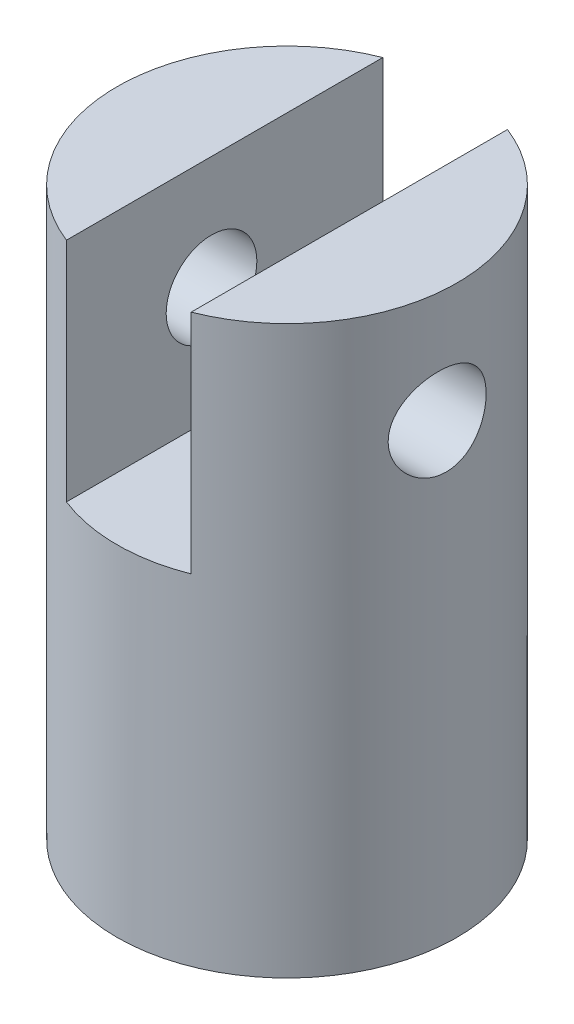
ISO-10303-21;
HEADER;
FILE_DESCRIPTION(('STEP AP214'),'2;1');
FILE_NAME('part.step','',(''),(''),'','','');
FILE_SCHEMA(('AUTOMOTIVE_DESIGN { 1 0 10303 214 1 1 1 1 }'));
ENDSEC;
DATA;
#1=APPLICATION_CONTEXT('core data for automotive mechanical design processes');
#2=APPLICATION_PROTOCOL_DEFINITION('international standard','automotive_design',2000,#1);
#3=PRODUCT_CONTEXT('',#1,'mechanical');
#4=PRODUCT('Part','Part','',(#3));
#5=PRODUCT_RELATED_PRODUCT_CATEGORY('part','',(#4));
#6=PRODUCT_DEFINITION_FORMATION('','',#4);
#7=PRODUCT_DEFINITION_CONTEXT('part definition',#1,'design');
#8=PRODUCT_DEFINITION('design','',#6,#7);
#9=PRODUCT_DEFINITION_SHAPE('','',#8);
#10=(LENGTH_UNIT() NAMED_UNIT(*) SI_UNIT(.MILLI.,.METRE.));
#11=(NAMED_UNIT(*) PLANE_ANGLE_UNIT() SI_UNIT($,.RADIAN.));
#12=(NAMED_UNIT(*) SI_UNIT($,.STERADIAN.) SOLID_ANGLE_UNIT());
#13=UNCERTAINTY_MEASURE_WITH_UNIT(LENGTH_MEASURE(1.E-05),#10,'distance_accuracy_value','');
#14=(GEOMETRIC_REPRESENTATION_CONTEXT(3) GLOBAL_UNCERTAINTY_ASSIGNED_CONTEXT((#13)) GLOBAL_UNIT_ASSIGNED_CONTEXT((#10,
#11,#12)) REPRESENTATION_CONTEXT('',''));
#15=CARTESIAN_POINT('',(0.,0.,0.));
#16=DIRECTION('',(0.,0.,1.));
#17=DIRECTION('',(1.,0.,0.));
#18=AXIS2_PLACEMENT_3D('',#15,#16,#17);
#19=CARTESIAN_POINT('',(0.,25.,0.));
#20=DIRECTION('',(0.,-1.,0.));
#21=DIRECTION('',(0.,0.,-1.));
#22=AXIS2_PLACEMENT_3D('',#19,#20,#21);
#23=CYLINDRICAL_SURFACE('',#22,7.5);
#24=CARTESIAN_POINT('',(-7.36431172824309,20.,-1.42018054107962));
#25=CARTESIAN_POINT('',(-7.36431341297471,19.8885742131786,-1.4201779213967));
#26=CARTESIAN_POINT('',(-7.36613176157616,19.7771196573364,-1.41084000474749));
#27=CARTESIAN_POINT('',(-7.37313321034491,19.5573888561167,-1.37377272900447));
#28=CARTESIAN_POINT('',(-7.37831792271149,19.4491141596017,-1.34603455763013));
#29=CARTESIAN_POINT('',(-7.39125938058877,19.2389123924031,-1.27304663606658));
#30=CARTESIAN_POINT('',(-7.39901392153605,19.1369799696279,-1.22781189001783));
#31=CARTESIAN_POINT('',(-7.41592676294349,18.9421207694588,-1.12113096111415));
#32=CARTESIAN_POINT('',(-7.42508509537839,18.8491941972738,-1.05968440897315));
#33=CARTESIAN_POINT('',(-7.44351272357116,18.6737724805367,-0.921426204528676));
#34=CARTESIAN_POINT('',(-7.45278205060338,18.5914137116721,-0.844441418896689));
#35=CARTESIAN_POINT('',(-7.46979286748862,18.4407031582009,-0.677648532090351));
#36=CARTESIAN_POINT('',(-7.47753435446648,18.3723513999534,-0.58784040678485));
#37=CARTESIAN_POINT('',(-7.49004616851589,18.2516041814593,-0.397823470689809));
#38=CARTESIAN_POINT('',(-7.49481544011791,18.1992143928722,-0.297610979905167));
#39=CARTESIAN_POINT('',(-7.50018329393405,18.1120279153892,-0.0897041072376774));
#40=CARTESIAN_POINT('',(-7.5007826444109,18.077227986848,0.0179888927495898));
#41=CARTESIAN_POINT('',(-7.49708292863424,18.0268632331567,0.235062169069167));
#42=CARTESIAN_POINT('',(-7.49289722455587,18.0108707341844,0.344345278947186));
#43=CARTESIAN_POINT('',(-7.47958985531353,17.9970465979117,0.56374648061554));
#44=CARTESIAN_POINT('',(-7.47046852805605,17.9992137175005,0.673864514735826));
#45=CARTESIAN_POINT('',(-7.44771156822449,18.0213358708249,0.890713252126069));
#46=CARTESIAN_POINT('',(-7.43412051444811,18.0411184170622,0.997466433291223));
#47=CARTESIAN_POINT('',(-7.40317314181643,18.0974461752469,1.20587579194215));
#48=CARTESIAN_POINT('',(-7.38581628265934,18.133993793415,1.30753123544685));
#49=CARTESIAN_POINT('',(-7.34796558856358,18.2239171574878,1.50595052140326));
#50=CARTESIAN_POINT('',(-7.32739861947904,18.2777279932047,1.60250299942168));
#51=CARTESIAN_POINT('',(-7.28502270835973,18.4003255321983,1.78529022710863));
#52=CARTESIAN_POINT('',(-7.2632134367787,18.4691162229792,1.87152222006665));
#53=CARTESIAN_POINT('',(-7.21928987568507,18.6227356191358,2.03451251903428));
#54=CARTESIAN_POINT('',(-7.19719323507588,18.7080557144115,2.11081351004229));
#55=CARTESIAN_POINT('',(-7.15552921139905,18.8908599026374,2.24801183343414));
#56=CARTESIAN_POINT('',(-7.13596181850091,18.9883439483067,2.30890922568852));
#57=CARTESIAN_POINT('',(-7.10145299575844,19.1921675381758,2.41295686301889));
#58=CARTESIAN_POINT('',(-7.0864767937521,19.2984323663152,2.45624136485345));
#59=CARTESIAN_POINT('',(-7.06259327043878,19.5174137570161,2.52410162542811));
#60=CARTESIAN_POINT('',(-7.05368313918205,19.6301273061091,2.54868604711456));
#61=CARTESIAN_POINT('',(-7.04326643509821,19.852271213768,2.57732736841168));
#62=CARTESIAN_POINT('',(-7.04138683565063,19.9615512715336,2.582418891831));
#63=CARTESIAN_POINT('',(-7.04419974902091,20.1793847011582,2.57473638656334));
#64=CARTESIAN_POINT('',(-7.04889127302284,20.2879381798824,2.56196504586228));
#65=CARTESIAN_POINT('',(-7.06410567804967,20.4980143897025,2.51969986656517));
#66=CARTESIAN_POINT('',(-7.07445689311712,20.5996495461675,2.49069774695678));
#67=CARTESIAN_POINT('',(-7.0998552797694,20.7965867302715,2.41734406573535));
#68=CARTESIAN_POINT('',(-7.11490325396907,20.8918876720972,2.37298988051342));
#69=CARTESIAN_POINT('',(-7.14893885911413,21.0771706579319,2.26843350655189));
#70=CARTESIAN_POINT('',(-7.16804719148391,21.166844586246,2.20772546091895));
#71=CARTESIAN_POINT('',(-7.20818453593919,21.335013142375,2.0729241762091));
#72=CARTESIAN_POINT('',(-7.2292141130799,21.4135044638006,1.99882699296114));
#73=CARTESIAN_POINT('',(-7.27261262363595,21.561319889009,1.83484467546273));
#74=CARTESIAN_POINT('',(-7.29499417465367,21.6299516980274,1.74433736429419));
#75=CARTESIAN_POINT('',(-7.33816227125004,21.7510759973294,1.55274201432112));
#76=CARTESIAN_POINT('',(-7.35894871290156,21.8035674366786,1.45165328711183));
#77=CARTESIAN_POINT('',(-7.39742553526468,21.8910794079603,1.24082128811738));
#78=CARTESIAN_POINT('',(-7.41509536706331,21.9259866090304,1.13102702479866));
#79=CARTESIAN_POINT('',(-7.44588025500723,21.9764947912806,0.9064723177167));
#80=CARTESIAN_POINT('',(-7.45899652884095,21.9921009367121,0.79171321087161));
#81=CARTESIAN_POINT('',(-7.4795218251267,22.0030432840623,0.565006062588848));
#82=CARTESIAN_POINT('',(-7.48712343240026,21.9991055782139,0.453110366854388));
#83=CARTESIAN_POINT('',(-7.49725326321192,21.9725670995884,0.23132739176592));
#84=CARTESIAN_POINT('',(-7.49978221537019,21.9499690077886,0.121439826217573));
#85=CARTESIAN_POINT('',(-7.50018571742622,21.8875369350511,-0.0903201711113251));
#86=CARTESIAN_POINT('',(-7.49817527129297,21.8481488858531,-0.192324426226403));
#87=CARTESIAN_POINT('',(-7.49057700289285,21.7533705728151,-0.388455452961707));
#88=CARTESIAN_POINT('',(-7.48498896490743,21.6979793441399,-0.482581749176581));
#89=CARTESIAN_POINT('',(-7.47130955892052,21.5719509520638,-0.66159308307131));
#90=CARTESIAN_POINT('',(-7.46318735615007,21.5011294288791,-0.746345852041894));
#91=CARTESIAN_POINT('',(-7.44585601874823,21.3465822231531,-0.903025438044558));
#92=CARTESIAN_POINT('',(-7.43664663464676,21.2628535775256,-0.974949301747681));
#93=CARTESIAN_POINT('',(-7.41837073731735,21.0826815504563,-1.10554620825429));
#94=CARTESIAN_POINT('',(-7.40931213058671,20.9859939996986,-1.16388381945147));
#95=CARTESIAN_POINT('',(-7.39297749897405,20.784097588692,-1.26350608602541));
#96=CARTESIAN_POINT('',(-7.3857005732377,20.6788930707515,-1.30479936663801));
#97=CARTESIAN_POINT('',(-7.37488600989857,20.4785033362865,-1.36449035524275));
#98=CARTESIAN_POINT('',(-7.37096065108708,20.384058813224,-1.38532982640225));
#99=CARTESIAN_POINT('',(-7.3656728570333,20.1930833103945,-1.41317564034526));
#100=CARTESIAN_POINT('',(-7.36431026839274,20.0965524558577,-1.42018281108216));
#101=CARTESIAN_POINT('',(-7.36431172824309,20.,-1.42018054107962));
#102=B_SPLINE_CURVE_WITH_KNOTS('',3,(#24,#25,#26,#27,#28,#29,#30,#31,#32,#33,#34,#35,#36,#37,
#38,#39,#40,#41,#42,#43,#44,#45,#46,#47,#48,#49,#50,#51,#52,#53,#54,#55,#56,#57,#58,#59,#60,#61,
#62,#63,#64,#65,#66,#67,#68,#69,#70,#71,#72,#73,#74,#75,#76,#77,#78,#79,#80,#81,#82,#83,#84,#85,
#86,#87,#88,#89,#90,#91,#92,#93,#94,#95,#96,#97,#98,#99,#100,#101),.UNSPECIFIED.,.T.,.F.,(4,2,2,
2,2,2,2,2,2,2,2,2,2,2,2,2,2,2,2,2,2,2,2,2,2,2,2,2,2,2,2,2,2,2,2,2,2,2,4),(0.,0.333926994205198,
0.668014028852793,1.00181520097943,1.33562397736479,1.67338083745032,2.01113833314011,
2.34901570234749,2.6868308196661,3.01680574781019,3.34675808781093,3.67351468625365,
4.00031819738472,4.33610782223688,4.67198694080557,5.02005405498339,5.36811981627719,
5.71348031981849,6.05868073502454,6.38528231502916,6.71183475364179,7.02899149819855,
7.34620247040491,7.67465320777417,8.00320085833809,8.34889660912881,8.69461486415547,
9.04253365283666,9.39035933111593,9.72536150692016,10.060315560623,10.3868791546445,
10.7134624413697,11.044185559936,11.3749847159396,11.7132444383748,12.0513327749391,
12.3407038650958,12.6300576339803),.UNSPECIFIED.);
#103=CARTESIAN_POINT('',(-7.36431172824309,20.,-1.42018054107962));
#104=VERTEX_POINT('',#103);
#105=EDGE_CURVE('E108',#104,#104,#102,.T.);
#106=ORIENTED_EDGE('',*,*,#105,.F.);
#107=EDGE_LOOP('',(#106));
#108=FACE_BOUND('',#107,.T.);
#109=CARTESIAN_POINT('',(0.,25.,0.));
#110=DIRECTION('',(0.,1.,0.));
#111=DIRECTION('',(0.,0.,1.));
#112=AXIS2_PLACEMENT_3D('',#109,#110,#111);
#113=CIRCLE('',#112,7.5);
#114=CARTESIAN_POINT('',(-2.75,25.,-6.97764286847643));
#115=VERTEX_POINT('',#114);
#116=CARTESIAN_POINT('',(-2.75,25.,6.97764286847643));
#117=VERTEX_POINT('',#116);
#118=EDGE_CURVE('E89',#115,#117,#113,.T.);
#119=ORIENTED_EDGE('',*,*,#118,.F.);
#120=DIRECTION('',(0.,-1.,0.));
#121=VECTOR('',#120,1.);
#122=CARTESIAN_POINT('',(-2.75,25.,-6.97764286847643));
#123=LINE('',#122,#121);
#124=CARTESIAN_POINT('',(-2.75,15.,-6.97764286847643));
#125=VERTEX_POINT('',#124);
#126=EDGE_CURVE('E95',#115,#125,#123,.T.);
#127=ORIENTED_EDGE('',*,*,#126,.T.);
#128=CARTESIAN_POINT('',(0.,15.,0.));
#129=DIRECTION('',(0.,1.,0.));
#130=DIRECTION('',(0.,0.,1.));
#131=AXIS2_PLACEMENT_3D('',#128,#129,#130);
#132=CIRCLE('',#131,7.5);
#133=CARTESIAN_POINT('',(2.75,15.,-6.97764286847643));
#134=VERTEX_POINT('',#133);
#135=EDGE_CURVE('E11',#134,#125,#132,.T.);
#136=ORIENTED_EDGE('',*,*,#135,.F.);
#137=DIRECTION('',(0.,-1.,0.));
#138=VECTOR('',#137,1.);
#139=CARTESIAN_POINT('',(2.75,25.,-6.97764286847643));
#140=LINE('',#139,#138);
#141=CARTESIAN_POINT('',(2.75,25.,-6.97764286847643));
#142=VERTEX_POINT('',#141);
#143=EDGE_CURVE('E74',#134,#142,#140,.F.);
#144=ORIENTED_EDGE('',*,*,#143,.T.);
#145=CARTESIAN_POINT('',(2.75,25.,6.97764286847643));
#146=VERTEX_POINT('',#145);
#147=EDGE_CURVE('E80',#146,#142,#113,.T.);
#148=ORIENTED_EDGE('',*,*,#147,.F.);
#149=DIRECTION('',(0.,-1.,0.));
#150=VECTOR('',#149,1.);
#151=CARTESIAN_POINT('',(2.75,25.,6.97764286847643));
#152=LINE('',#151,#150);
#153=CARTESIAN_POINT('',(2.75,15.,6.97764286847643));
#154=VERTEX_POINT('',#153);
#155=EDGE_CURVE('E46',#146,#154,#152,.T.);
#156=ORIENTED_EDGE('',*,*,#155,.T.);
#157=CARTESIAN_POINT('',(-2.75,15.,6.97764286847643));
#158=VERTEX_POINT('',#157);
#159=EDGE_CURVE('E35',#158,#154,#132,.T.);
#160=ORIENTED_EDGE('',*,*,#159,.F.);
#161=DIRECTION('',(0.,-1.,0.));
#162=VECTOR('',#161,1.);
#163=CARTESIAN_POINT('',(-2.75,25.,6.97764286847643));
#164=LINE('',#163,#162);
#165=EDGE_CURVE('E54',#158,#117,#164,.F.);
#166=ORIENTED_EDGE('',*,*,#165,.T.);
#167=EDGE_LOOP('',(#119,#127,#136,#144,#148,#156,#160,#166));
#168=FACE_BOUND('',#167,.T.);
#169=CARTESIAN_POINT('',(0.,0.,0.));
#170=DIRECTION('',(0.,1.,0.));
#171=DIRECTION('',(0.,0.,1.));
#172=AXIS2_PLACEMENT_3D('',#169,#170,#171);
#173=CIRCLE('',#172,7.5);
#174=CARTESIAN_POINT('',(0.,0.,7.5));
#175=VERTEX_POINT('',#174);
#176=EDGE_CURVE('E92',#175,#175,#173,.T.);
#177=ORIENTED_EDGE('',*,*,#176,.T.);
#178=EDGE_LOOP('',(#177));
#179=FACE_BOUND('',#178,.T.);
#180=CARTESIAN_POINT('',(7.04233850076633,20.,2.57981945892038));
#181=CARTESIAN_POINT('',(7.04234064800225,20.1083968115738,2.57981677866619));
#182=CARTESIAN_POINT('',(7.04559837009967,20.2168208386702,2.57097318205379));
#183=CARTESIAN_POINT('',(7.0582808625524,20.4304843447929,2.53594277351657));
#184=CARTESIAN_POINT('',(7.06770893872784,20.5357220850993,2.50974666474315));
#185=CARTESIAN_POINT('',(7.0917233173342,20.7398380199213,2.4410591524967));
#186=CARTESIAN_POINT('',(7.10629878652443,20.8387290591419,2.39860195648715));
#187=CARTESIAN_POINT('',(7.13921967191571,21.027957804659,2.29875941434437));
#188=CARTESIAN_POINT('',(7.15756558792916,21.1182943746491,2.24137208879687));
#189=CARTESIAN_POINT('',(7.19713784875171,21.291466057001,2.11092549334895));
#190=CARTESIAN_POINT('',(7.21844419532049,21.373913297895,2.03737579576383));
#191=CARTESIAN_POINT('',(7.26158682749937,21.5255601182079,1.87781277893599));
#192=CARTESIAN_POINT('',(7.28342323014868,21.5947567412807,1.79179668581814));
#193=CARTESIAN_POINT('',(7.326721390735,21.7205935793157,1.60580336833079));
#194=CARTESIAN_POINT('',(7.34813585735615,21.7766434595021,1.50541436122471));
#195=CARTESIAN_POINT('',(7.38794203643095,21.8708931145462,1.29601532957284));
#196=CARTESIAN_POINT('',(7.40633404738959,21.9090946528367,1.18700615795219));
#197=CARTESIAN_POINT('',(7.43845567803539,21.965786988859,0.965253513693215));
#198=CARTESIAN_POINT('',(7.45225706659277,21.984591915799,0.852601057720659));
#199=CARTESIAN_POINT('',(7.4747645543345,22.0027311160522,0.625243837885396));
#200=CARTESIAN_POINT('',(7.48347200995181,22.0020705751176,0.510539628763693));
#201=CARTESIAN_POINT('',(7.49530704677369,21.9815158724678,0.287079592848922));
#202=CARTESIAN_POINT('',(7.49863750056136,21.9623669331125,0.178265338595447));
#203=CARTESIAN_POINT('',(7.50067605807694,21.9064139332346,-0.0347635218918591));
#204=CARTESIAN_POINT('',(7.49938435616284,21.869610615121,-0.138978321342581));
#205=CARTESIAN_POINT('',(7.49300086694072,21.7798380921834,-0.338919035243164));
#206=CARTESIAN_POINT('',(7.48794344787894,21.7270176380494,-0.434713016938481));
#207=CARTESIAN_POINT('',(7.47518945873714,21.6065937499656,-0.616312018542271));
#208=CARTESIAN_POINT('',(7.4674925562931,21.5389884546954,-0.702115778657464));
#209=CARTESIAN_POINT('',(7.4506015535285,21.3891812845696,-0.863282488374595));
#210=CARTESIAN_POINT('',(7.44137828936879,21.3066914995969,-0.93837481468878));
#211=CARTESIAN_POINT('',(7.42304181559985,21.130383318743,-1.07384161255738));
#212=CARTESIAN_POINT('',(7.41392861614182,21.0365638865816,-1.13421473627481));
#213=CARTESIAN_POINT('',(7.3970875527059,20.8386660079964,-1.23934819878504));
#214=CARTESIAN_POINT('',(7.38938159862642,20.7344589591775,-1.28387044319775));
#215=CARTESIAN_POINT('',(7.37672072381169,20.5198789000898,-1.35473188136107));
#216=CARTESIAN_POINT('',(7.37176550806755,20.4095065524298,-1.38107302505703));
#217=CARTESIAN_POINT('',(7.36541750873975,20.1871557545722,-1.4145372251051));
#218=CARTESIAN_POINT('',(7.36398221225276,20.0752130632084,-1.42188968138558));
#219=CARTESIAN_POINT('',(7.3647700444385,19.8516893014052,-1.41780343698285));
#220=CARTESIAN_POINT('',(7.36699295028763,19.7401082093554,-1.40636588081228));
#221=CARTESIAN_POINT('',(7.37471133215918,19.5217786643303,-1.36530421179298));
#222=CARTESIAN_POINT('',(7.38016963770447,19.4149899153751,-1.33588654898015));
#223=CARTESIAN_POINT('',(7.39351475250498,19.2078483305642,-1.25992730263959));
#224=CARTESIAN_POINT('',(7.40140178834192,19.1074960962411,-1.21338412135469));
#225=CARTESIAN_POINT('',(7.41853573930679,18.9147428194511,-1.10382364467195));
#226=CARTESIAN_POINT('',(7.42779788779577,18.822452089625,-1.04061469894254));
#227=CARTESIAN_POINT('',(7.4461774110599,18.6496580048608,-0.899709709753193));
#228=CARTESIAN_POINT('',(7.45529477280056,18.5691557058777,-0.822012369902946));
#229=CARTESIAN_POINT('',(7.47198660712045,18.4212720422891,-0.653206678480994));
#230=CARTESIAN_POINT('',(7.47954179381424,18.3540550930208,-0.561952146440062));
#231=CARTESIAN_POINT('',(7.49152513898017,18.2359090671495,-0.369259378026854));
#232=CARTESIAN_POINT('',(7.49595369244954,18.184977933554,-0.267822429880647));
#233=CARTESIAN_POINT('',(7.50047860113433,18.1016020644205,-0.059318695939846));
#234=CARTESIAN_POINT('',(7.50064014385268,18.068886645235,0.0476383295841629));
#235=CARTESIAN_POINT('',(7.4960930715274,18.0217314201626,0.265399802435978));
#236=CARTESIAN_POINT('',(7.4913852127918,18.0072887769505,0.376203649698358));
#237=CARTESIAN_POINT('',(7.47707731577089,17.9971055489041,0.595976811953123));
#238=CARTESIAN_POINT('',(7.46758290361459,18.0009756962575,0.704935333888915));
#239=CARTESIAN_POINT('',(7.44411047038299,18.0262146084234,0.920303331879524));
#240=CARTESIAN_POINT('',(7.43013220423238,18.0475843298143,1.02671266826105));
#241=CARTESIAN_POINT('',(7.39832735752873,18.1073238534022,1.2353192754756));
#242=CARTESIAN_POINT('',(7.38046016478205,18.1458779405305,1.33745738967522));
#243=CARTESIAN_POINT('',(7.34218123672579,18.2388026565226,1.53374970312961));
#244=CARTESIAN_POINT('',(7.32176894861798,18.2931767249399,1.62790216040096));
#245=CARTESIAN_POINT('',(7.27906757126342,18.4186763820368,1.80947850871063));
#246=CARTESIAN_POINT('',(7.25673642492092,18.4903686574372,1.89650117361072));
#247=CARTESIAN_POINT('',(7.21276918132685,18.6474561493601,2.05740923516736));
#248=CARTESIAN_POINT('',(7.19113329202841,18.7328554207258,2.13129073068847));
#249=CARTESIAN_POINT('',(7.15013566412565,18.9169058918997,2.26507215453407));
#250=CARTESIAN_POINT('',(7.1308209439773,19.0157648546515,2.32470153004114));
#251=CARTESIAN_POINT('',(7.0969087544258,19.222886964997,2.42626759088913));
#252=CARTESIAN_POINT('',(7.08230711003633,19.3311416810645,2.46821994519378));
#253=CARTESIAN_POINT('',(7.06161872548633,19.5326540502561,2.52671825429832));
#254=CARTESIAN_POINT('',(7.05444090501662,19.6248499046784,2.54657811884169));
#255=CARTESIAN_POINT('',(7.04480029132981,19.8113572302539,2.57312867805691));
#256=CARTESIAN_POINT('',(7.04233663214685,19.9056683096309,2.5798217913959));
#257=CARTESIAN_POINT('',(7.04233850076633,20.,2.57981945892038));
#258=B_SPLINE_CURVE_WITH_KNOTS('',3,(#180,#181,#182,#183,#184,#185,#186,#187,#188,#189,#190,
#191,#192,#193,#194,#195,#196,#197,#198,#199,#200,#201,#202,#203,#204,#205,#206,#207,#208,#209,
#210,#211,#212,#213,#214,#215,#216,#217,#218,#219,#220,#221,#222,#223,#224,#225,#226,#227,#228,
#229,#230,#231,#232,#233,#234,#235,#236,#237,#238,#239,#240,#241,#242,#243,#244,#245,#246,#247,
#248,#249,#250,#251,#252,#253,#254,#255,#256,#257),.UNSPECIFIED.,.T.,.F.,(4,2,2,2,2,2,2,2,2,2,2,
2,2,2,2,2,2,2,2,2,2,2,2,2,2,2,2,2,2,2,2,2,2,2,2,2,2,2,4),(0.,0.324837336430042,
0.649848849874885,0.974180378596587,1.29855492863926,1.63462415996134,1.97076828457301,
2.31993557230177,2.66906835467739,3.01245364665844,3.35574745895197,3.68575772413909,
4.01575411281893,4.34277510939199,4.66983729961324,5.00408096867318,5.33835523293102,
5.67745751819994,6.01652342867924,6.35147354447716,6.68640325898852,7.01755768323431,
7.34874301098651,7.68391686645708,8.01912072696585,8.35824380168183,8.69732402626328,
9.03122104595582,9.36506621305706,9.69184723696392,10.0186461248791,10.3490372260981,
10.6795002141371,11.0227478620658,11.3660972382893,11.7155225070968,12.0646373894012,
12.347377121532,12.6300649109194),.UNSPECIFIED.);
#259=CARTESIAN_POINT('',(7.04233850076633,20.,2.57981945892038));
#260=VERTEX_POINT('',#259);
#261=EDGE_CURVE('E103',#260,#260,#258,.T.);
#262=ORIENTED_EDGE('',*,*,#261,.T.);
#263=EDGE_LOOP('',(#262));
#264=FACE_BOUND('',#263,.T.);
#265=ADVANCED_FACE('F32',(#108,#168,#179,#264),#23,.T.);
#266=CARTESIAN_POINT('',(0.,25.,0.));
#267=DIRECTION('',(0.,1.,0.));
#268=DIRECTION('',(0.,0.,1.));
#269=AXIS2_PLACEMENT_3D('',#266,#267,#268);
#270=PLANE('',#269);
#271=DIRECTION('',(0.,0.,1.));
#272=VECTOR('',#271,1.);
#273=CARTESIAN_POINT('',(-2.75,25.,0.));
#274=LINE('',#273,#272);
#275=EDGE_CURVE('E79',#115,#117,#274,.T.);
#276=ORIENTED_EDGE('',*,*,#275,.F.);
#277=ORIENTED_EDGE('',*,*,#118,.T.);
#278=EDGE_LOOP('',(#276,#277));
#279=FACE_BOUND('',#278,.T.);
#280=ADVANCED_FACE('F142',(#279),#270,.T.);
#281=DIRECTION('',(0.,0.,-1.));
#282=VECTOR('',#281,1.);
#283=CARTESIAN_POINT('',(2.75,25.,0.));
#284=LINE('',#283,#282);
#285=EDGE_CURVE('E71',#146,#142,#284,.T.);
#286=ORIENTED_EDGE('',*,*,#285,.F.);
#287=ORIENTED_EDGE('',*,*,#147,.T.);
#288=EDGE_LOOP('',(#286,#287));
#289=FACE_BOUND('',#288,.T.);
#290=ADVANCED_FACE('F88',(#289),#270,.T.);
#291=CARTESIAN_POINT('',(0.,0.,0.));
#292=DIRECTION('',(0.,1.,0.));
#293=DIRECTION('',(0.,0.,1.));
#294=AXIS2_PLACEMENT_3D('',#291,#292,#293);
#295=PLANE('',#294);
#296=ORIENTED_EDGE('',*,*,#176,.F.);
#297=EDGE_LOOP('',(#296));
#298=FACE_BOUND('',#297,.T.);
#299=ADVANCED_FACE('F166',(#298),#295,.F.);
#300=CARTESIAN_POINT('',(0.,15.,0.));
#301=DIRECTION('',(0.,1.,0.));
#302=DIRECTION('',(0.,0.,1.));
#303=AXIS2_PLACEMENT_3D('',#300,#301,#302);
#304=PLANE('',#303);
#305=DIRECTION('',(0.,0.,-1.));
#306=VECTOR('',#305,1.);
#307=CARTESIAN_POINT('',(2.75,15.,7.5));
#308=LINE('',#307,#306);
#309=EDGE_CURVE('E102',#154,#134,#308,.T.);
#310=ORIENTED_EDGE('',*,*,#309,.T.);
#311=ORIENTED_EDGE('',*,*,#135,.T.);
#312=DIRECTION('',(0.,0.,1.));
#313=VECTOR('',#312,1.);
#314=CARTESIAN_POINT('',(-2.75,15.,7.5));
#315=LINE('',#314,#313);
#316=EDGE_CURVE('E86',#125,#158,#315,.T.);
#317=ORIENTED_EDGE('',*,*,#316,.T.);
#318=ORIENTED_EDGE('',*,*,#159,.T.);
#319=EDGE_LOOP('',(#310,#311,#317,#318));
#320=FACE_BOUND('',#319,.T.);
#321=ADVANCED_FACE('F101',(#320),#304,.T.);
#322=CARTESIAN_POINT('',(-2.75,15.,7.5));
#323=DIRECTION('',(-1.,0.,0.));
#324=DIRECTION('',(0.,0.,1.));
#325=AXIS2_PLACEMENT_3D('',#322,#323,#324);
#326=PLANE('',#325);
#327=CARTESIAN_POINT('',(-2.75,20.,0.579819458920383));
#328=DIRECTION('',(-1.,0.,0.));
#329=DIRECTION('',(0.,0.,1.));
#330=AXIS2_PLACEMENT_3D('',#327,#328,#329);
#331=CIRCLE('',#330,2.);
#332=CARTESIAN_POINT('',(-2.75,20.,2.57981945892038));
#333=VERTEX_POINT('',#332);
#334=EDGE_CURVE('E117',#333,#333,#331,.F.);
#335=ORIENTED_EDGE('',*,*,#334,.F.);
#336=EDGE_LOOP('',(#335));
#337=FACE_BOUND('',#336,.T.);
#338=ORIENTED_EDGE('',*,*,#275,.T.);
#339=ORIENTED_EDGE('',*,*,#165,.F.);
#340=ORIENTED_EDGE('',*,*,#316,.F.);
#341=ORIENTED_EDGE('',*,*,#126,.F.);
#342=EDGE_LOOP('',(#338,#339,#340,#341));
#343=FACE_BOUND('',#342,.T.);
#344=ADVANCED_FACE('F158',(#337,#343),#326,.F.);
#345=CARTESIAN_POINT('',(2.75,15.,7.5));
#346=DIRECTION('',(1.,0.,0.));
#347=DIRECTION('',(0.,0.,-1.));
#348=AXIS2_PLACEMENT_3D('',#345,#346,#347);
#349=PLANE('',#348);
#350=CARTESIAN_POINT('',(2.75,20.,0.579819458920383));
#351=DIRECTION('',(1.,0.,0.));
#352=DIRECTION('',(0.,0.,-1.));
#353=AXIS2_PLACEMENT_3D('',#350,#351,#352);
#354=CIRCLE('',#353,2.);
#355=CARTESIAN_POINT('',(2.75,20.,-1.42018054107962));
#356=VERTEX_POINT('',#355);
#357=EDGE_CURVE('E116',#356,#356,#354,.T.);
#358=ORIENTED_EDGE('',*,*,#357,.T.);
#359=EDGE_LOOP('',(#358));
#360=FACE_BOUND('',#359,.T.);
#361=ORIENTED_EDGE('',*,*,#285,.T.);
#362=ORIENTED_EDGE('',*,*,#143,.F.);
#363=ORIENTED_EDGE('',*,*,#309,.F.);
#364=ORIENTED_EDGE('',*,*,#155,.F.);
#365=EDGE_LOOP('',(#361,#362,#363,#364));
#366=FACE_BOUND('',#365,.T.);
#367=ADVANCED_FACE('F73',(#360,#366),#349,.F.);
#368=CARTESIAN_POINT('',(7.501,20.,0.579819458920383));
#369=DIRECTION('',(-1.,0.,0.));
#370=DIRECTION('',(0.,0.,1.));
#371=AXIS2_PLACEMENT_3D('',#368,#369,#370);
#372=CYLINDRICAL_SURFACE('',#371,2.);
#373=ORIENTED_EDGE('',*,*,#357,.F.);
#374=EDGE_LOOP('',(#373));
#375=FACE_BOUND('',#374,.T.);
#376=ORIENTED_EDGE('',*,*,#261,.F.);
#377=EDGE_LOOP('',(#376));
#378=FACE_BOUND('',#377,.T.);
#379=ADVANCED_FACE('F124',(#375,#378),#372,.F.);
#380=CARTESIAN_POINT('',(-7.501,20.,0.579819458920383));
#381=DIRECTION('',(1.,0.,0.));
#382=DIRECTION('',(0.,0.,-1.));
#383=AXIS2_PLACEMENT_3D('',#380,#381,#382);
#384=CYLINDRICAL_SURFACE('',#383,2.);
#385=ORIENTED_EDGE('',*,*,#334,.T.);
#386=EDGE_LOOP('',(#385));
#387=FACE_BOUND('',#386,.T.);
#388=ORIENTED_EDGE('',*,*,#105,.T.);
#389=EDGE_LOOP('',(#388));
#390=FACE_BOUND('',#389,.T.);
#391=ADVANCED_FACE('F119',(#387,#390),#384,.F.);
#392=CLOSED_SHELL('',(#265,#280,#290,#299,#321,#344,#367,#379,#391));
#393=MANIFOLD_SOLID_BREP('B2',#392);
#394=ADVANCED_BREP_SHAPE_REPRESENTATION('',(#18,#393),#14);
#395=SHAPE_DEFINITION_REPRESENTATION(#9,#394);
ENDSEC;
END-ISO-10303-21;
